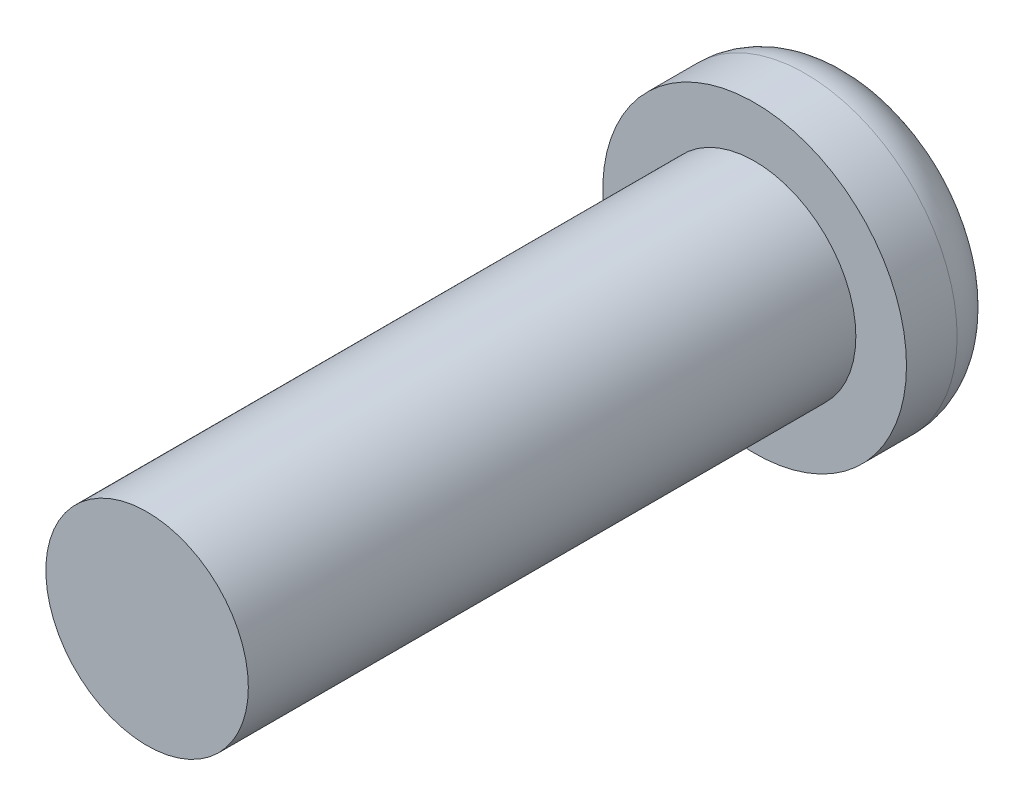
ISO-10303-21;
HEADER;
FILE_DESCRIPTION(('STEP AP214'),'2;1');
FILE_NAME('part.step','',(''),(''),'','','');
FILE_SCHEMA(('AUTOMOTIVE_DESIGN { 1 0 10303 214 1 1 1 1 }'));
ENDSEC;
DATA;
#1=APPLICATION_CONTEXT('core data for automotive mechanical design processes');
#2=APPLICATION_PROTOCOL_DEFINITION('international standard','automotive_design',2000,#1);
#3=PRODUCT_CONTEXT('',#1,'mechanical');
#4=PRODUCT('Part','Part','',(#3));
#5=PRODUCT_RELATED_PRODUCT_CATEGORY('part','',(#4));
#6=PRODUCT_DEFINITION_FORMATION('','',#4);
#7=PRODUCT_DEFINITION_CONTEXT('part definition',#1,'design');
#8=PRODUCT_DEFINITION('design','',#6,#7);
#9=PRODUCT_DEFINITION_SHAPE('','',#8);
#10=(LENGTH_UNIT() NAMED_UNIT(*) SI_UNIT(.MILLI.,.METRE.));
#11=(NAMED_UNIT(*) PLANE_ANGLE_UNIT() SI_UNIT($,.RADIAN.));
#12=(NAMED_UNIT(*) SI_UNIT($,.STERADIAN.) SOLID_ANGLE_UNIT());
#13=UNCERTAINTY_MEASURE_WITH_UNIT(LENGTH_MEASURE(1.E-05),#10,'distance_accuracy_value','');
#14=(GEOMETRIC_REPRESENTATION_CONTEXT(3) GLOBAL_UNCERTAINTY_ASSIGNED_CONTEXT((#13)) GLOBAL_UNIT_ASSIGNED_CONTEXT((#10,
#11,#12)) REPRESENTATION_CONTEXT('',''));
#15=CARTESIAN_POINT('',(0.,0.,0.));
#16=DIRECTION('',(0.,0.,1.));
#17=DIRECTION('',(1.,0.,0.));
#18=AXIS2_PLACEMENT_3D('',#15,#16,#17);
#19=CARTESIAN_POINT('',(0.,0.,1.));
#20=DIRECTION('',(0.,0.,-1.));
#21=DIRECTION('',(-1.,0.,0.));
#22=AXIS2_PLACEMENT_3D('',#19,#20,#21);
#23=CYLINDRICAL_SURFACE('',#22,1.5);
#24=CARTESIAN_POINT('',(0.,0.,0.5));
#25=DIRECTION('',(0.,0.,1.));
#26=DIRECTION('',(1.,0.,0.));
#27=AXIS2_PLACEMENT_3D('',#24,#25,#26);
#28=CIRCLE('',#27,1.5);
#29=CARTESIAN_POINT('',(1.5,0.,0.5));
#30=VERTEX_POINT('',#29);
#31=EDGE_CURVE('E48',#30,#30,#28,.T.);
#32=ORIENTED_EDGE('',*,*,#31,.T.);
#33=EDGE_LOOP('',(#32));
#34=FACE_BOUND('',#33,.T.);
#35=CARTESIAN_POINT('',(0.,0.,1.));
#36=DIRECTION('',(0.,0.,1.));
#37=DIRECTION('',(1.,0.,0.));
#38=AXIS2_PLACEMENT_3D('',#35,#36,#37);
#39=CIRCLE('',#38,1.5);
#40=CARTESIAN_POINT('',(1.5,0.,1.));
#41=VERTEX_POINT('',#40);
#42=EDGE_CURVE('E167',#41,#41,#39,.T.);
#43=ORIENTED_EDGE('',*,*,#42,.F.);
#44=EDGE_LOOP('',(#43));
#45=FACE_BOUND('',#44,.T.);
#46=ADVANCED_FACE('F39',(#34,#45),#23,.T.);
#47=CARTESIAN_POINT('',(0.,0.,1.));
#48=DIRECTION('',(0.,0.,1.));
#49=DIRECTION('',(1.,0.,0.));
#50=AXIS2_PLACEMENT_3D('',#47,#48,#49);
#51=PLANE('',#50);
#52=CARTESIAN_POINT('',(0.,0.,1.));
#53=DIRECTION('',(0.,0.,1.));
#54=DIRECTION('',(1.,0.,0.));
#55=AXIS2_PLACEMENT_3D('',#52,#53,#54);
#56=CIRCLE('',#55,1.);
#57=CARTESIAN_POINT('',(1.,0.,1.));
#58=VERTEX_POINT('',#57);
#59=EDGE_CURVE('E168',#58,#58,#56,.T.);
#60=ORIENTED_EDGE('',*,*,#59,.F.);
#61=EDGE_LOOP('',(#60));
#62=FACE_BOUND('',#61,.T.);
#63=ORIENTED_EDGE('',*,*,#42,.T.);
#64=EDGE_LOOP('',(#63));
#65=FACE_BOUND('',#64,.T.);
#66=ADVANCED_FACE('F189',(#62,#65),#51,.T.);
#67=CARTESIAN_POINT('',(0.,0.,0.));
#68=DIRECTION('',(0.,0.,1.));
#69=DIRECTION('',(1.,0.,0.));
#70=AXIS2_PLACEMENT_3D('',#67,#68,#69);
#71=PLANE('',#70);
#72=CARTESIAN_POINT('',(0.,0.,0.));
#73=DIRECTION('',(0.,0.,1.));
#74=DIRECTION('',(1.,0.,0.));
#75=AXIS2_PLACEMENT_3D('',#72,#73,#74);
#76=CIRCLE('',#75,1.);
#77=CARTESIAN_POINT('',(1.,0.,0.));
#78=VERTEX_POINT('',#77);
#79=EDGE_CURVE('E11',#78,#78,#76,.F.);
#80=ORIENTED_EDGE('',*,*,#79,.T.);
#81=EDGE_LOOP('',(#80));
#82=FACE_BOUND('',#81,.T.);
#83=DIRECTION('',(-0.545655910212218,0.838009324321917,0.));
#84=VECTOR('',#83,1.);
#85=CARTESIAN_POINT('',(-0.261487368837991,-0.514740409596448,0.));
#86=LINE('',#85,#84);
#87=CARTESIAN_POINT('',(-0.261487368837991,-0.514740409596448,0.));
#88=VERTEX_POINT('',#87);
#89=CARTESIAN_POINT('',(-0.576521955483926,-0.0309155006157711,0.));
#90=VERTEX_POINT('',#89);
#91=EDGE_CURVE('E135',#88,#90,#86,.T.);
#92=ORIENTED_EDGE('',*,*,#91,.F.);
#93=DIRECTION('',(-0.998565318577122,-0.0535472178079432,0.));
#94=VECTOR('',#93,1.);
#95=CARTESIAN_POINT('',(0.315034586645935,-0.483824908980676,0.));
#96=LINE('',#95,#94);
#97=CARTESIAN_POINT('',(0.315034586645935,-0.483824908980676,0.));
#98=VERTEX_POINT('',#97);
#99=EDGE_CURVE('E55',#98,#88,#96,.T.);
#100=ORIENTED_EDGE('',*,*,#99,.F.);
#101=DIRECTION('',(-0.452909408364904,-0.89155654212986,0.));
#102=VECTOR('',#101,1.);
#103=CARTESIAN_POINT('',(0.576521955483927,0.0309155006157713,0.));
#104=LINE('',#103,#102);
#105=CARTESIAN_POINT('',(0.576521955483927,0.0309155006157713,0.));
#106=VERTEX_POINT('',#105);
#107=EDGE_CURVE('E148',#106,#98,#104,.T.);
#108=ORIENTED_EDGE('',*,*,#107,.F.);
#109=DIRECTION('',(0.545655910212218,-0.838009324321917,0.));
#110=VECTOR('',#109,1.);
#111=CARTESIAN_POINT('',(0.261487368837991,0.514740409596448,0.));
#112=LINE('',#111,#110);
#113=CARTESIAN_POINT('',(0.261487368837991,0.514740409596448,0.));
#114=VERTEX_POINT('',#113);
#115=EDGE_CURVE('E145',#114,#106,#112,.T.);
#116=ORIENTED_EDGE('',*,*,#115,.F.);
#117=DIRECTION('',(0.998565318577122,0.0535472178079433,0.));
#118=VECTOR('',#117,1.);
#119=CARTESIAN_POINT('',(-0.315034586645934,0.483824908980677,0.));
#120=LINE('',#119,#118);
#121=CARTESIAN_POINT('',(-0.315034586645934,0.483824908980677,0.));
#122=VERTEX_POINT('',#121);
#123=EDGE_CURVE('E103',#122,#114,#120,.T.);
#124=ORIENTED_EDGE('',*,*,#123,.F.);
#125=DIRECTION('',(0.452909408364904,0.89155654212986,0.));
#126=VECTOR('',#125,1.);
#127=CARTESIAN_POINT('',(-0.576521955483926,-0.0309155006157711,0.));
#128=LINE('',#127,#126);
#129=EDGE_CURVE('E139',#90,#122,#128,.T.);
#130=ORIENTED_EDGE('',*,*,#129,.F.);
#131=EDGE_LOOP('',(#92,#100,#108,#116,#124,#130));
#132=FACE_BOUND('',#131,.T.);
#133=ADVANCED_FACE('F193',(#82,#132),#71,.F.);
#134=CARTESIAN_POINT('',(0.,0.,7.));
#135=DIRECTION('',(0.,0.,-1.));
#136=DIRECTION('',(-1.,0.,0.));
#137=AXIS2_PLACEMENT_3D('',#134,#135,#136);
#138=CYLINDRICAL_SURFACE('',#137,1.);
#139=CARTESIAN_POINT('',(0.,0.,7.));
#140=DIRECTION('',(0.,0.,1.));
#141=DIRECTION('',(1.,0.,0.));
#142=AXIS2_PLACEMENT_3D('',#139,#140,#141);
#143=CIRCLE('',#142,1.);
#144=CARTESIAN_POINT('',(1.,0.,7.));
#145=VERTEX_POINT('',#144);
#146=EDGE_CURVE('E154',#145,#145,#143,.T.);
#147=ORIENTED_EDGE('',*,*,#146,.F.);
#148=EDGE_LOOP('',(#147));
#149=FACE_BOUND('',#148,.T.);
#150=ORIENTED_EDGE('',*,*,#59,.T.);
#151=EDGE_LOOP('',(#150));
#152=FACE_BOUND('',#151,.T.);
#153=ADVANCED_FACE('F198',(#149,#152),#138,.T.);
#154=CARTESIAN_POINT('',(0.,0.,7.));
#155=DIRECTION('',(0.,0.,1.));
#156=DIRECTION('',(1.,0.,0.));
#157=AXIS2_PLACEMENT_3D('',#154,#155,#156);
#158=PLANE('',#157);
#159=ORIENTED_EDGE('',*,*,#146,.T.);
#160=EDGE_LOOP('',(#159));
#161=FACE_BOUND('',#160,.T.);
#162=ADVANCED_FACE('F203',(#161),#158,.T.);
#163=CARTESIAN_POINT('',(0.315034586645935,-0.483824908980676,0.75));
#164=DIRECTION('',(0.0535472178079432,-0.998565318577122,0.));
#165=DIRECTION('',(0.998565318577122,0.0535472178079432,0.));
#166=AXIS2_PLACEMENT_3D('',#163,#164,#165);
#167=PLANE('',#166);
#168=ORIENTED_EDGE('',*,*,#99,.T.);
#169=DIRECTION('',(0.,0.,-1.));
#170=VECTOR('',#169,1.);
#171=CARTESIAN_POINT('',(-0.261487368837991,-0.514740409596448,0.75));
#172=LINE('',#171,#170);
#173=CARTESIAN_POINT('',(-0.261487368837991,-0.514740409596448,0.75));
#174=VERTEX_POINT('',#173);
#175=EDGE_CURVE('E85',#174,#88,#172,.T.);
#176=ORIENTED_EDGE('',*,*,#175,.F.);
#177=DIRECTION('',(-0.998565318577122,-0.0535472178079432,0.));
#178=VECTOR('',#177,1.);
#179=CARTESIAN_POINT('',(0.315034586645935,-0.483824908980676,0.75));
#180=LINE('',#179,#178);
#181=CARTESIAN_POINT('',(0.315034586645935,-0.483824908980676,0.75));
#182=VERTEX_POINT('',#181);
#183=EDGE_CURVE('E151',#182,#174,#180,.T.);
#184=ORIENTED_EDGE('',*,*,#183,.F.);
#185=DIRECTION('',(0.,0.,-1.));
#186=VECTOR('',#185,1.);
#187=CARTESIAN_POINT('',(0.315034586645935,-0.483824908980676,0.75));
#188=LINE('',#187,#186);
#189=EDGE_CURVE('E63',#182,#98,#188,.T.);
#190=ORIENTED_EDGE('',*,*,#189,.T.);
#191=EDGE_LOOP('',(#168,#176,#184,#190));
#192=FACE_BOUND('',#191,.T.);
#193=ADVANCED_FACE('F207',(#192),#167,.F.);
#194=CARTESIAN_POINT('',(0.576521955483927,0.0309155006157713,0.75));
#195=DIRECTION('',(0.89155654212986,-0.452909408364904,0.));
#196=DIRECTION('',(0.452909408364904,0.89155654212986,0.));
#197=AXIS2_PLACEMENT_3D('',#194,#195,#196);
#198=PLANE('',#197);
#199=ORIENTED_EDGE('',*,*,#107,.T.);
#200=ORIENTED_EDGE('',*,*,#189,.F.);
#201=DIRECTION('',(-0.452909408364904,-0.89155654212986,0.));
#202=VECTOR('',#201,1.);
#203=CARTESIAN_POINT('',(0.576521955483927,0.0309155006157713,0.75));
#204=LINE('',#203,#202);
#205=CARTESIAN_POINT('',(0.576521955483927,0.0309155006157713,0.75));
#206=VERTEX_POINT('',#205);
#207=EDGE_CURVE('E117',#206,#182,#204,.T.);
#208=ORIENTED_EDGE('',*,*,#207,.F.);
#209=DIRECTION('',(0.,0.,-1.));
#210=VECTOR('',#209,1.);
#211=CARTESIAN_POINT('',(0.576521955483927,0.0309155006157713,0.75));
#212=LINE('',#211,#210);
#213=EDGE_CURVE('E108',#206,#106,#212,.T.);
#214=ORIENTED_EDGE('',*,*,#213,.T.);
#215=EDGE_LOOP('',(#199,#200,#208,#214));
#216=FACE_BOUND('',#215,.T.);
#217=ADVANCED_FACE('F211',(#216),#198,.F.);
#218=CARTESIAN_POINT('',(0.261487368837991,0.514740409596448,0.75));
#219=DIRECTION('',(0.838009324321917,0.545655910212218,0.));
#220=DIRECTION('',(-0.545655910212218,0.838009324321917,0.));
#221=AXIS2_PLACEMENT_3D('',#218,#219,#220);
#222=PLANE('',#221);
#223=ORIENTED_EDGE('',*,*,#115,.T.);
#224=ORIENTED_EDGE('',*,*,#213,.F.);
#225=DIRECTION('',(0.545655910212218,-0.838009324321917,0.));
#226=VECTOR('',#225,1.);
#227=CARTESIAN_POINT('',(0.261487368837991,0.514740409596448,0.75));
#228=LINE('',#227,#226);
#229=CARTESIAN_POINT('',(0.261487368837991,0.514740409596448,0.75));
#230=VERTEX_POINT('',#229);
#231=EDGE_CURVE('E112',#230,#206,#228,.T.);
#232=ORIENTED_EDGE('',*,*,#231,.F.);
#233=DIRECTION('',(0.,0.,-1.));
#234=VECTOR('',#233,1.);
#235=CARTESIAN_POINT('',(0.261487368837991,0.514740409596448,0.75));
#236=LINE('',#235,#234);
#237=EDGE_CURVE('E96',#230,#114,#236,.T.);
#238=ORIENTED_EDGE('',*,*,#237,.T.);
#239=EDGE_LOOP('',(#223,#224,#232,#238));
#240=FACE_BOUND('',#239,.T.);
#241=ADVANCED_FACE('F113',(#240),#222,.F.);
#242=CARTESIAN_POINT('',(-0.315034586645934,0.483824908980677,0.75));
#243=DIRECTION('',(-0.0535472178079433,0.998565318577122,0.));
#244=DIRECTION('',(-0.998565318577122,-0.0535472178079433,0.));
#245=AXIS2_PLACEMENT_3D('',#242,#243,#244);
#246=PLANE('',#245);
#247=ORIENTED_EDGE('',*,*,#123,.T.);
#248=ORIENTED_EDGE('',*,*,#237,.F.);
#249=DIRECTION('',(0.998565318577122,0.0535472178079433,0.));
#250=VECTOR('',#249,1.);
#251=CARTESIAN_POINT('',(-0.315034586645934,0.483824908980677,0.75));
#252=LINE('',#251,#250);
#253=CARTESIAN_POINT('',(-0.315034586645934,0.483824908980677,0.75));
#254=VERTEX_POINT('',#253);
#255=EDGE_CURVE('E100',#254,#230,#252,.T.);
#256=ORIENTED_EDGE('',*,*,#255,.F.);
#257=DIRECTION('',(0.,0.,-1.));
#258=VECTOR('',#257,1.);
#259=CARTESIAN_POINT('',(-0.315034586645934,0.483824908980677,0.75));
#260=LINE('',#259,#258);
#261=EDGE_CURVE('E109',#254,#122,#260,.T.);
#262=ORIENTED_EDGE('',*,*,#261,.T.);
#263=EDGE_LOOP('',(#247,#248,#256,#262));
#264=FACE_BOUND('',#263,.T.);
#265=ADVANCED_FACE('F98',(#264),#246,.F.);
#266=CARTESIAN_POINT('',(-0.576521955483926,-0.0309155006157711,0.75));
#267=DIRECTION('',(-0.89155654212986,0.452909408364904,0.));
#268=DIRECTION('',(-0.452909408364904,-0.89155654212986,0.));
#269=AXIS2_PLACEMENT_3D('',#266,#267,#268);
#270=PLANE('',#269);
#271=ORIENTED_EDGE('',*,*,#129,.T.);
#272=ORIENTED_EDGE('',*,*,#261,.F.);
#273=DIRECTION('',(0.452909408364904,0.89155654212986,0.));
#274=VECTOR('',#273,1.);
#275=CARTESIAN_POINT('',(-0.576521955483926,-0.0309155006157711,0.75));
#276=LINE('',#275,#274);
#277=CARTESIAN_POINT('',(-0.576521955483926,-0.0309155006157711,0.75));
#278=VERTEX_POINT('',#277);
#279=EDGE_CURVE('E123',#278,#254,#276,.T.);
#280=ORIENTED_EDGE('',*,*,#279,.F.);
#281=DIRECTION('',(0.,0.,-1.));
#282=VECTOR('',#281,1.);
#283=CARTESIAN_POINT('',(-0.576521955483926,-0.0309155006157711,0.75));
#284=LINE('',#283,#282);
#285=EDGE_CURVE('E159',#278,#90,#284,.T.);
#286=ORIENTED_EDGE('',*,*,#285,.T.);
#287=EDGE_LOOP('',(#271,#272,#280,#286));
#288=FACE_BOUND('',#287,.T.);
#289=ADVANCED_FACE('F214',(#288),#270,.F.);
#290=CARTESIAN_POINT('',(-0.261487368837991,-0.514740409596448,0.75));
#291=DIRECTION('',(-0.838009324321917,-0.545655910212218,0.));
#292=DIRECTION('',(0.545655910212218,-0.838009324321917,0.));
#293=AXIS2_PLACEMENT_3D('',#290,#291,#292);
#294=PLANE('',#293);
#295=ORIENTED_EDGE('',*,*,#91,.T.);
#296=ORIENTED_EDGE('',*,*,#285,.F.);
#297=DIRECTION('',(-0.545655910212218,0.838009324321917,0.));
#298=VECTOR('',#297,1.);
#299=CARTESIAN_POINT('',(-0.261487368837991,-0.514740409596448,0.75));
#300=LINE('',#299,#298);
#301=EDGE_CURVE('E127',#174,#278,#300,.T.);
#302=ORIENTED_EDGE('',*,*,#301,.F.);
#303=ORIENTED_EDGE('',*,*,#175,.T.);
#304=EDGE_LOOP('',(#295,#296,#302,#303));
#305=FACE_BOUND('',#304,.T.);
#306=ADVANCED_FACE('F185',(#305),#294,.F.);
#307=CARTESIAN_POINT('',(0.,0.,0.75));
#308=DIRECTION('',(0.,0.,-1.));
#309=DIRECTION('',(-1.,0.,0.));
#310=AXIS2_PLACEMENT_3D('',#307,#308,#309);
#311=PLANE('',#310);
#312=ORIENTED_EDGE('',*,*,#183,.T.);
#313=ORIENTED_EDGE('',*,*,#301,.T.);
#314=ORIENTED_EDGE('',*,*,#279,.T.);
#315=ORIENTED_EDGE('',*,*,#255,.T.);
#316=ORIENTED_EDGE('',*,*,#231,.T.);
#317=ORIENTED_EDGE('',*,*,#207,.T.);
#318=EDGE_LOOP('',(#312,#313,#314,#315,#316,#317));
#319=FACE_BOUND('',#318,.T.);
#320=ADVANCED_FACE('F120',(#319),#311,.T.);
#321=CARTESIAN_POINT('',(0.,0.,0.5));
#322=DIRECTION('',(0.,0.,1.));
#323=DIRECTION('',(1.,0.,0.));
#324=AXIS2_PLACEMENT_3D('',#321,#322,#323);
#325=TOROIDAL_SURFACE('',#324,1.,0.5);
#326=ORIENTED_EDGE('',*,*,#79,.F.);
#327=EDGE_LOOP('',(#326));
#328=FACE_BOUND('',#327,.T.);
#329=ORIENTED_EDGE('',*,*,#31,.F.);
#330=EDGE_LOOP('',(#329));
#331=FACE_BOUND('',#330,.T.);
#332=ADVANCED_FACE('F41',(#328,#331),#325,.T.);
#333=CLOSED_SHELL('',(#46,#66,#133,#153,#162,#193,#217,#241,#265,#289,#306,#320,#332));
#334=MANIFOLD_SOLID_BREP('B2',#333);
#335=ADVANCED_BREP_SHAPE_REPRESENTATION('',(#18,#334),#14);
#336=SHAPE_DEFINITION_REPRESENTATION(#9,#335);
ENDSEC;
END-ISO-10303-21;
